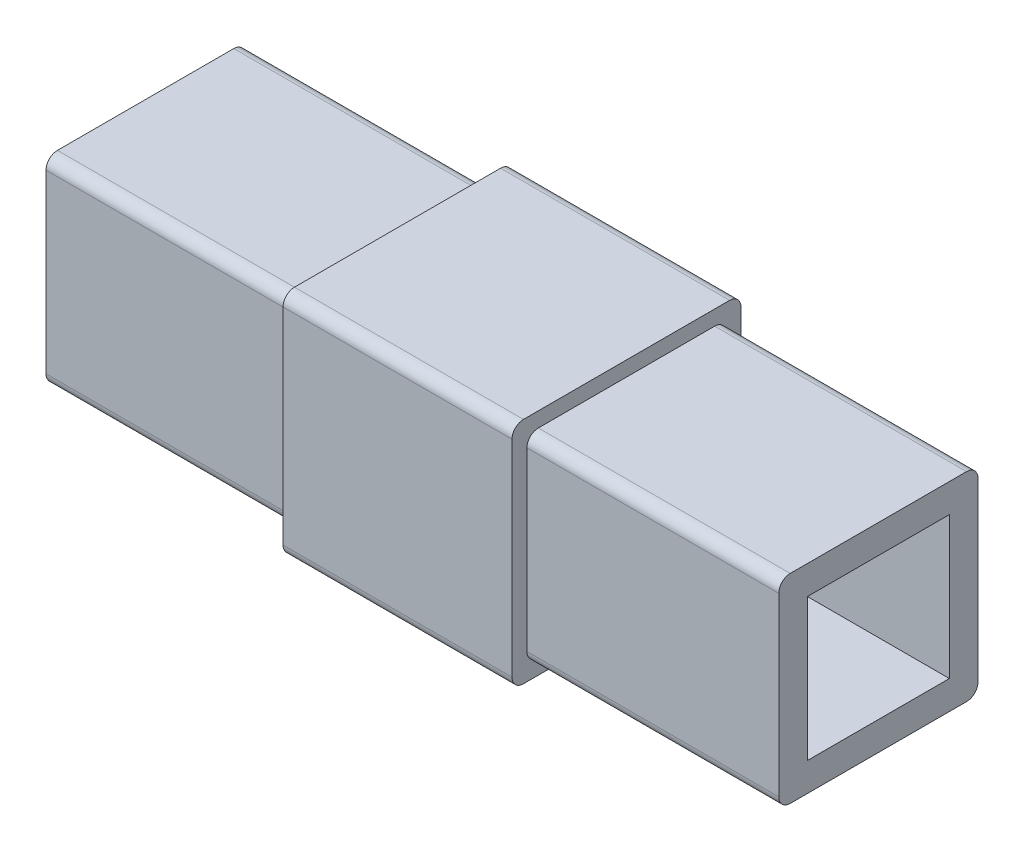
ISO-10303-21;
HEADER;
FILE_DESCRIPTION(('STEP AP214'),'2;1');
FILE_NAME('part.step','',(''),(''),'','','');
FILE_SCHEMA(('AUTOMOTIVE_DESIGN { 1 0 10303 214 1 1 1 1 }'));
ENDSEC;
DATA;
#1=APPLICATION_CONTEXT('core data for automotive mechanical design processes');
#2=APPLICATION_PROTOCOL_DEFINITION('international standard','automotive_design',2000,#1);
#3=PRODUCT_CONTEXT('',#1,'mechanical');
#4=PRODUCT('Part','Part','',(#3));
#5=PRODUCT_RELATED_PRODUCT_CATEGORY('part','',(#4));
#6=PRODUCT_DEFINITION_FORMATION('','',#4);
#7=PRODUCT_DEFINITION_CONTEXT('part definition',#1,'design');
#8=PRODUCT_DEFINITION('design','',#6,#7);
#9=PRODUCT_DEFINITION_SHAPE('','',#8);
#10=(LENGTH_UNIT() NAMED_UNIT(*) SI_UNIT(.MILLI.,.METRE.));
#11=(NAMED_UNIT(*) PLANE_ANGLE_UNIT() SI_UNIT($,.RADIAN.));
#12=(NAMED_UNIT(*) SI_UNIT($,.STERADIAN.) SOLID_ANGLE_UNIT());
#13=UNCERTAINTY_MEASURE_WITH_UNIT(LENGTH_MEASURE(1.E-05),#10,'distance_accuracy_value','');
#14=(GEOMETRIC_REPRESENTATION_CONTEXT(3) GLOBAL_UNCERTAINTY_ASSIGNED_CONTEXT((#13)) GLOBAL_UNIT_ASSIGNED_CONTEXT((#10,
#11,#12)) REPRESENTATION_CONTEXT('',''));
#15=CARTESIAN_POINT('',(0.,0.,0.));
#16=DIRECTION('',(0.,0.,1.));
#17=DIRECTION('',(1.,0.,0.));
#18=AXIS2_PLACEMENT_3D('',#15,#16,#17);
#19=CARTESIAN_POINT('',(12.7,11.43,12.7));
#20=DIRECTION('',(0.,0.,-1.));
#21=DIRECTION('',(-1.,0.,0.));
#22=AXIS2_PLACEMENT_3D('',#19,#20,#21);
#23=PLANE('',#22);
#24=DIRECTION('',(0.,-1.,0.));
#25=VECTOR('',#24,1.);
#26=CARTESIAN_POINT('',(-12.7,11.43,12.7));
#27=LINE('',#26,#25);
#28=CARTESIAN_POINT('',(-12.7,11.43,12.7));
#29=VERTEX_POINT('',#28);
#30=CARTESIAN_POINT('',(-12.7,-11.43,12.7));
#31=VERTEX_POINT('',#30);
#32=EDGE_CURVE('E10',#29,#31,#27,.T.);
#33=ORIENTED_EDGE('',*,*,#32,.T.);
#34=DIRECTION('',(-1.,0.,0.));
#35=VECTOR('',#34,1.);
#36=CARTESIAN_POINT('',(12.7,-11.43,12.7));
#37=LINE('',#36,#35);
#38=CARTESIAN_POINT('',(12.7,-11.43,12.7));
#39=VERTEX_POINT('',#38);
#40=EDGE_CURVE('E24',#39,#31,#37,.T.);
#41=ORIENTED_EDGE('',*,*,#40,.F.);
#42=DIRECTION('',(0.,-1.,0.));
#43=VECTOR('',#42,1.);
#44=CARTESIAN_POINT('',(12.7,11.43,12.7));
#45=LINE('',#44,#43);
#46=CARTESIAN_POINT('',(12.7,11.43,12.7));
#47=VERTEX_POINT('',#46);
#48=EDGE_CURVE('E667',#47,#39,#45,.T.);
#49=ORIENTED_EDGE('',*,*,#48,.F.);
#50=DIRECTION('',(-1.,0.,0.));
#51=VECTOR('',#50,1.);
#52=CARTESIAN_POINT('',(12.7,11.43,12.7));
#53=LINE('',#52,#51);
#54=EDGE_CURVE('E663',#47,#29,#53,.T.);
#55=ORIENTED_EDGE('',*,*,#54,.T.);
#56=EDGE_LOOP('',(#33,#41,#49,#55));
#57=FACE_BOUND('',#56,.T.);
#58=ADVANCED_FACE('F16',(#57),#23,.F.);
#59=CARTESIAN_POINT('',(12.7,11.4300000000002,11.4300000000002));
#60=DIRECTION('',(-1.,0.,0.));
#61=DIRECTION('',(0.,-0.707106781186548,-0.707106781186547));
#62=AXIS2_PLACEMENT_3D('',#59,#60,#61);
#63=CYLINDRICAL_SURFACE('',#62,1.26999999999977);
#64=CARTESIAN_POINT('',(-12.7,11.4300000000002,11.4300000000002));
#65=DIRECTION('',(1.,0.,0.));
#66=DIRECTION('',(0.,0.,-1.));
#67=AXIS2_PLACEMENT_3D('',#64,#65,#66);
#68=CIRCLE('',#67,1.26999999999977);
#69=CARTESIAN_POINT('',(-12.7,12.7,11.43));
#70=VERTEX_POINT('',#69);
#71=EDGE_CURVE('E658',#70,#29,#68,.T.);
#72=ORIENTED_EDGE('',*,*,#71,.T.);
#73=ORIENTED_EDGE('',*,*,#54,.F.);
#74=CARTESIAN_POINT('',(12.7,11.4300000000002,11.4300000000002));
#75=DIRECTION('',(1.,0.,0.));
#76=DIRECTION('',(0.,0.,-1.));
#77=AXIS2_PLACEMENT_3D('',#74,#75,#76);
#78=CIRCLE('',#77,1.26999999999977);
#79=CARTESIAN_POINT('',(12.7,12.7,11.43));
#80=VERTEX_POINT('',#79);
#81=EDGE_CURVE('E653',#80,#47,#78,.T.);
#82=ORIENTED_EDGE('',*,*,#81,.F.);
#83=DIRECTION('',(-1.,0.,0.));
#84=VECTOR('',#83,1.);
#85=CARTESIAN_POINT('',(12.7,12.7,11.43));
#86=LINE('',#85,#84);
#87=EDGE_CURVE('E649',#80,#70,#86,.T.);
#88=ORIENTED_EDGE('',*,*,#87,.T.);
#89=EDGE_LOOP('',(#72,#73,#82,#88));
#90=FACE_BOUND('',#89,.T.);
#91=ADVANCED_FACE('F685',(#90),#63,.T.);
#92=CARTESIAN_POINT('',(12.7,12.7,-11.43));
#93=DIRECTION('',(0.,-1.,0.));
#94=DIRECTION('',(0.,0.,-1.));
#95=AXIS2_PLACEMENT_3D('',#92,#93,#94);
#96=PLANE('',#95);
#97=DIRECTION('',(0.,0.,1.));
#98=VECTOR('',#97,1.);
#99=CARTESIAN_POINT('',(-12.7,12.7,-11.43));
#100=LINE('',#99,#98);
#101=CARTESIAN_POINT('',(-12.7,12.7,-11.43));
#102=VERTEX_POINT('',#101);
#103=EDGE_CURVE('E644',#102,#70,#100,.T.);
#104=ORIENTED_EDGE('',*,*,#103,.T.);
#105=ORIENTED_EDGE('',*,*,#87,.F.);
#106=DIRECTION('',(0.,0.,1.));
#107=VECTOR('',#106,1.);
#108=CARTESIAN_POINT('',(12.7,12.7,-11.43));
#109=LINE('',#108,#107);
#110=CARTESIAN_POINT('',(12.7,12.7,-11.43));
#111=VERTEX_POINT('',#110);
#112=EDGE_CURVE('E639',#111,#80,#109,.T.);
#113=ORIENTED_EDGE('',*,*,#112,.F.);
#114=DIRECTION('',(-1.,0.,0.));
#115=VECTOR('',#114,1.);
#116=CARTESIAN_POINT('',(12.7,12.7,-11.43));
#117=LINE('',#116,#115);
#118=EDGE_CURVE('E635',#111,#102,#117,.T.);
#119=ORIENTED_EDGE('',*,*,#118,.T.);
#120=EDGE_LOOP('',(#104,#105,#113,#119));
#121=FACE_BOUND('',#120,.T.);
#122=ADVANCED_FACE('F706',(#121),#96,.F.);
#123=CARTESIAN_POINT('',(12.7,11.4300000000002,-11.4300000000002));
#124=DIRECTION('',(-1.,0.,0.));
#125=DIRECTION('',(0.,-0.707106781186548,0.707106781186547));
#126=AXIS2_PLACEMENT_3D('',#123,#124,#125);
#127=CYLINDRICAL_SURFACE('',#126,1.26999999999977);
#128=CARTESIAN_POINT('',(-12.7,11.4300000000002,-11.4300000000002));
#129=DIRECTION('',(1.,0.,0.));
#130=DIRECTION('',(0.,0.,-1.));
#131=AXIS2_PLACEMENT_3D('',#128,#129,#130);
#132=CIRCLE('',#131,1.26999999999977);
#133=CARTESIAN_POINT('',(-12.7,11.43,-12.7));
#134=VERTEX_POINT('',#133);
#135=EDGE_CURVE('E630',#134,#102,#132,.T.);
#136=ORIENTED_EDGE('',*,*,#135,.T.);
#137=ORIENTED_EDGE('',*,*,#118,.F.);
#138=CARTESIAN_POINT('',(12.7,11.4300000000002,-11.4300000000002));
#139=DIRECTION('',(1.,0.,0.));
#140=DIRECTION('',(0.,0.,-1.));
#141=AXIS2_PLACEMENT_3D('',#138,#139,#140);
#142=CIRCLE('',#141,1.26999999999977);
#143=CARTESIAN_POINT('',(12.7,11.43,-12.7));
#144=VERTEX_POINT('',#143);
#145=EDGE_CURVE('E625',#144,#111,#142,.T.);
#146=ORIENTED_EDGE('',*,*,#145,.F.);
#147=DIRECTION('',(-1.,0.,0.));
#148=VECTOR('',#147,1.);
#149=CARTESIAN_POINT('',(12.7,11.43,-12.7));
#150=LINE('',#149,#148);
#151=EDGE_CURVE('E621',#144,#134,#150,.T.);
#152=ORIENTED_EDGE('',*,*,#151,.T.);
#153=EDGE_LOOP('',(#136,#137,#146,#152));
#154=FACE_BOUND('',#153,.T.);
#155=ADVANCED_FACE('F703',(#154),#127,.T.);
#156=CARTESIAN_POINT('',(12.7,-11.43,-12.7));
#157=DIRECTION('',(0.,0.,1.));
#158=DIRECTION('',(1.,0.,0.));
#159=AXIS2_PLACEMENT_3D('',#156,#157,#158);
#160=PLANE('',#159);
#161=DIRECTION('',(0.,1.,0.));
#162=VECTOR('',#161,1.);
#163=CARTESIAN_POINT('',(-12.7,-11.43,-12.7));
#164=LINE('',#163,#162);
#165=CARTESIAN_POINT('',(-12.7,-11.43,-12.7));
#166=VERTEX_POINT('',#165);
#167=EDGE_CURVE('E616',#166,#134,#164,.T.);
#168=ORIENTED_EDGE('',*,*,#167,.T.);
#169=ORIENTED_EDGE('',*,*,#151,.F.);
#170=DIRECTION('',(0.,1.,0.));
#171=VECTOR('',#170,1.);
#172=CARTESIAN_POINT('',(12.7,-11.43,-12.7));
#173=LINE('',#172,#171);
#174=CARTESIAN_POINT('',(12.7,-11.43,-12.7));
#175=VERTEX_POINT('',#174);
#176=EDGE_CURVE('E611',#175,#144,#173,.T.);
#177=ORIENTED_EDGE('',*,*,#176,.F.);
#178=DIRECTION('',(-1.,0.,0.));
#179=VECTOR('',#178,1.);
#180=CARTESIAN_POINT('',(12.7,-11.43,-12.7));
#181=LINE('',#180,#179);
#182=EDGE_CURVE('E607',#175,#166,#181,.T.);
#183=ORIENTED_EDGE('',*,*,#182,.T.);
#184=EDGE_LOOP('',(#168,#169,#177,#183));
#185=FACE_BOUND('',#184,.T.);
#186=ADVANCED_FACE('F699',(#185),#160,.F.);
#187=CARTESIAN_POINT('',(12.7,-11.4300000000002,-11.4300000000002));
#188=DIRECTION('',(-1.,0.,0.));
#189=DIRECTION('',(0.,0.707106781186548,0.707106781186547));
#190=AXIS2_PLACEMENT_3D('',#187,#188,#189);
#191=CYLINDRICAL_SURFACE('',#190,1.26999999999977);
#192=CARTESIAN_POINT('',(-12.7,-11.4300000000002,-11.4300000000002));
#193=DIRECTION('',(1.,0.,0.));
#194=DIRECTION('',(0.,0.,-1.));
#195=AXIS2_PLACEMENT_3D('',#192,#193,#194);
#196=CIRCLE('',#195,1.26999999999977);
#197=CARTESIAN_POINT('',(-12.7,-12.7,-11.43));
#198=VERTEX_POINT('',#197);
#199=EDGE_CURVE('E602',#198,#166,#196,.T.);
#200=ORIENTED_EDGE('',*,*,#199,.T.);
#201=ORIENTED_EDGE('',*,*,#182,.F.);
#202=CARTESIAN_POINT('',(12.7,-11.4300000000002,-11.4300000000002));
#203=DIRECTION('',(1.,0.,0.));
#204=DIRECTION('',(0.,0.,-1.));
#205=AXIS2_PLACEMENT_3D('',#202,#203,#204);
#206=CIRCLE('',#205,1.26999999999977);
#207=CARTESIAN_POINT('',(12.7,-12.7,-11.43));
#208=VERTEX_POINT('',#207);
#209=EDGE_CURVE('E597',#208,#175,#206,.T.);
#210=ORIENTED_EDGE('',*,*,#209,.F.);
#211=DIRECTION('',(-1.,0.,0.));
#212=VECTOR('',#211,1.);
#213=CARTESIAN_POINT('',(12.7,-12.7,-11.43));
#214=LINE('',#213,#212);
#215=EDGE_CURVE('E593',#208,#198,#214,.T.);
#216=ORIENTED_EDGE('',*,*,#215,.T.);
#217=EDGE_LOOP('',(#200,#201,#210,#216));
#218=FACE_BOUND('',#217,.T.);
#219=ADVANCED_FACE('F697',(#218),#191,.T.);
#220=CARTESIAN_POINT('',(12.7,-12.7,11.43));
#221=DIRECTION('',(0.,1.,0.));
#222=DIRECTION('',(0.,0.,1.));
#223=AXIS2_PLACEMENT_3D('',#220,#221,#222);
#224=PLANE('',#223);
#225=DIRECTION('',(0.,0.,-1.));
#226=VECTOR('',#225,1.);
#227=CARTESIAN_POINT('',(-12.7,-12.7,11.43));
#228=LINE('',#227,#226);
#229=CARTESIAN_POINT('',(-12.7,-12.7,11.43));
#230=VERTEX_POINT('',#229);
#231=EDGE_CURVE('E588',#230,#198,#228,.T.);
#232=ORIENTED_EDGE('',*,*,#231,.T.);
#233=ORIENTED_EDGE('',*,*,#215,.F.);
#234=DIRECTION('',(0.,0.,-1.));
#235=VECTOR('',#234,1.);
#236=CARTESIAN_POINT('',(12.7,-12.7,11.43));
#237=LINE('',#236,#235);
#238=CARTESIAN_POINT('',(12.7,-12.7,11.43));
#239=VERTEX_POINT('',#238);
#240=EDGE_CURVE('E583',#239,#208,#237,.T.);
#241=ORIENTED_EDGE('',*,*,#240,.F.);
#242=DIRECTION('',(-1.,0.,0.));
#243=VECTOR('',#242,1.);
#244=CARTESIAN_POINT('',(12.7,-12.7,11.43));
#245=LINE('',#244,#243);
#246=EDGE_CURVE('E579',#239,#230,#245,.T.);
#247=ORIENTED_EDGE('',*,*,#246,.T.);
#248=EDGE_LOOP('',(#232,#233,#241,#247));
#249=FACE_BOUND('',#248,.T.);
#250=ADVANCED_FACE('F694',(#249),#224,.F.);
#251=CARTESIAN_POINT('',(12.7,-11.4300000000002,11.4300000000002));
#252=DIRECTION('',(-1.,0.,0.));
#253=DIRECTION('',(0.,0.707106781186547,-0.707106781186548));
#254=AXIS2_PLACEMENT_3D('',#251,#252,#253);
#255=CYLINDRICAL_SURFACE('',#254,1.26999999999977);
#256=CARTESIAN_POINT('',(-12.7,-11.4300000000002,11.4300000000002));
#257=DIRECTION('',(1.,0.,0.));
#258=DIRECTION('',(0.,0.,-1.));
#259=AXIS2_PLACEMENT_3D('',#256,#257,#258);
#260=CIRCLE('',#259,1.26999999999977);
#261=EDGE_CURVE('E574',#31,#230,#260,.T.);
#262=ORIENTED_EDGE('',*,*,#261,.T.);
#263=ORIENTED_EDGE('',*,*,#246,.F.);
#264=CARTESIAN_POINT('',(12.7,-11.4300000000002,11.4300000000002));
#265=DIRECTION('',(1.,0.,0.));
#266=DIRECTION('',(0.,0.,-1.));
#267=AXIS2_PLACEMENT_3D('',#264,#265,#266);
#268=CIRCLE('',#267,1.26999999999977);
#269=EDGE_CURVE('E569',#39,#239,#268,.T.);
#270=ORIENTED_EDGE('',*,*,#269,.F.);
#271=ORIENTED_EDGE('',*,*,#40,.T.);
#272=EDGE_LOOP('',(#262,#263,#270,#271));
#273=FACE_BOUND('',#272,.T.);
#274=ADVANCED_FACE('F677',(#273),#255,.T.);
#275=CARTESIAN_POINT('',(12.7,-11.4300000000002,11.4300000000002));
#276=DIRECTION('',(1.,0.,0.));
#277=DIRECTION('',(0.,0.,-1.));
#278=AXIS2_PLACEMENT_3D('',#275,#276,#277);
#279=PLANE('',#278);
#280=CARTESIAN_POINT('',(12.7,-9.77900000000023,9.77900000000023));
#281=DIRECTION('',(-1.,0.,0.));
#282=DIRECTION('',(0.,0.,-1.));
#283=AXIS2_PLACEMENT_3D('',#280,#281,#282);
#284=CIRCLE('',#283,1.26999999999977);
#285=CARTESIAN_POINT('',(12.7,-11.049,9.779));
#286=VERTEX_POINT('',#285);
#287=CARTESIAN_POINT('',(12.7,-9.779,11.049));
#288=VERTEX_POINT('',#287);
#289=EDGE_CURVE('E565',#286,#288,#284,.T.);
#290=ORIENTED_EDGE('',*,*,#289,.T.);
#291=DIRECTION('',(0.,1.,0.));
#292=VECTOR('',#291,1.);
#293=CARTESIAN_POINT('',(12.7,-11.4300000000002,11.049));
#294=LINE('',#293,#292);
#295=CARTESIAN_POINT('',(12.7,9.779,11.049));
#296=VERTEX_POINT('',#295);
#297=EDGE_CURVE('E561',#288,#296,#294,.T.);
#298=ORIENTED_EDGE('',*,*,#297,.T.);
#299=CARTESIAN_POINT('',(12.7,9.77900000000023,9.77900000000023));
#300=DIRECTION('',(-1.,0.,0.));
#301=DIRECTION('',(0.,0.,-1.));
#302=AXIS2_PLACEMENT_3D('',#299,#300,#301);
#303=CIRCLE('',#302,1.26999999999977);
#304=CARTESIAN_POINT('',(12.7,11.049,9.779));
#305=VERTEX_POINT('',#304);
#306=EDGE_CURVE('E557',#296,#305,#303,.T.);
#307=ORIENTED_EDGE('',*,*,#306,.T.);
#308=DIRECTION('',(0.,0.,-1.));
#309=VECTOR('',#308,1.);
#310=CARTESIAN_POINT('',(12.7,11.049,11.4300000000002));
#311=LINE('',#310,#309);
#312=CARTESIAN_POINT('',(12.7,11.049,-9.779));
#313=VERTEX_POINT('',#312);
#314=EDGE_CURVE('E553',#305,#313,#311,.T.);
#315=ORIENTED_EDGE('',*,*,#314,.T.);
#316=CARTESIAN_POINT('',(12.7,9.77900000000023,-9.77900000000023));
#317=DIRECTION('',(-1.,0.,0.));
#318=DIRECTION('',(0.,0.,-1.));
#319=AXIS2_PLACEMENT_3D('',#316,#317,#318);
#320=CIRCLE('',#319,1.26999999999977);
#321=CARTESIAN_POINT('',(12.7,9.779,-11.049));
#322=VERTEX_POINT('',#321);
#323=EDGE_CURVE('E549',#313,#322,#320,.T.);
#324=ORIENTED_EDGE('',*,*,#323,.T.);
#325=DIRECTION('',(0.,-1.,0.));
#326=VECTOR('',#325,1.);
#327=CARTESIAN_POINT('',(12.7,-11.4300000000002,-11.049));
#328=LINE('',#327,#326);
#329=CARTESIAN_POINT('',(12.7,-9.779,-11.049));
#330=VERTEX_POINT('',#329);
#331=EDGE_CURVE('E545',#322,#330,#328,.T.);
#332=ORIENTED_EDGE('',*,*,#331,.T.);
#333=CARTESIAN_POINT('',(12.7,-9.77900000000023,-9.77900000000023));
#334=DIRECTION('',(-1.,0.,0.));
#335=DIRECTION('',(0.,0.,-1.));
#336=AXIS2_PLACEMENT_3D('',#333,#334,#335);
#337=CIRCLE('',#336,1.26999999999977);
#338=CARTESIAN_POINT('',(12.7,-11.049,-9.779));
#339=VERTEX_POINT('',#338);
#340=EDGE_CURVE('E541',#330,#339,#337,.T.);
#341=ORIENTED_EDGE('',*,*,#340,.T.);
#342=DIRECTION('',(0.,0.,1.));
#343=VECTOR('',#342,1.);
#344=CARTESIAN_POINT('',(12.7,-11.049,11.4300000000002));
#345=LINE('',#344,#343);
#346=EDGE_CURVE('E537',#339,#286,#345,.T.);
#347=ORIENTED_EDGE('',*,*,#346,.T.);
#348=EDGE_LOOP('',(#290,#298,#307,#315,#324,#332,#341,#347));
#349=FACE_BOUND('',#348,.T.);
#350=ORIENTED_EDGE('',*,*,#48,.T.);
#351=ORIENTED_EDGE('',*,*,#269,.T.);
#352=ORIENTED_EDGE('',*,*,#240,.T.);
#353=ORIENTED_EDGE('',*,*,#209,.T.);
#354=ORIENTED_EDGE('',*,*,#176,.T.);
#355=ORIENTED_EDGE('',*,*,#145,.T.);
#356=ORIENTED_EDGE('',*,*,#112,.T.);
#357=ORIENTED_EDGE('',*,*,#81,.T.);
#358=EDGE_LOOP('',(#350,#351,#352,#353,#354,#355,#356,#357));
#359=FACE_BOUND('',#358,.T.);
#360=ADVANCED_FACE('F681',(#349,#359),#279,.T.);
#361=CARTESIAN_POINT('',(40.64,-11.049,9.779));
#362=DIRECTION('',(0.,1.,0.));
#363=DIRECTION('',(0.,0.,1.));
#364=AXIS2_PLACEMENT_3D('',#361,#362,#363);
#365=PLANE('',#364);
#366=ORIENTED_EDGE('',*,*,#346,.F.);
#367=DIRECTION('',(-1.,0.,0.));
#368=VECTOR('',#367,1.);
#369=CARTESIAN_POINT('',(40.64,-11.049,-9.779));
#370=LINE('',#369,#368);
#371=CARTESIAN_POINT('',(40.64,-11.049,-9.779));
#372=VERTEX_POINT('',#371);
#373=EDGE_CURVE('E532',#372,#339,#370,.T.);
#374=ORIENTED_EDGE('',*,*,#373,.F.);
#375=DIRECTION('',(0.,0.,-1.));
#376=VECTOR('',#375,1.);
#377=CARTESIAN_POINT('',(40.64,-11.049,9.779));
#378=LINE('',#377,#376);
#379=CARTESIAN_POINT('',(40.64,-11.049,9.779));
#380=VERTEX_POINT('',#379);
#381=EDGE_CURVE('E527',#380,#372,#378,.T.);
#382=ORIENTED_EDGE('',*,*,#381,.F.);
#383=DIRECTION('',(-1.,0.,0.));
#384=VECTOR('',#383,1.);
#385=CARTESIAN_POINT('',(40.64,-11.049,9.779));
#386=LINE('',#385,#384);
#387=EDGE_CURVE('E522',#380,#286,#386,.T.);
#388=ORIENTED_EDGE('',*,*,#387,.T.);
#389=EDGE_LOOP('',(#366,#374,#382,#388));
#390=FACE_BOUND('',#389,.T.);
#391=ADVANCED_FACE('F785',(#390),#365,.F.);
#392=CARTESIAN_POINT('',(40.64,-9.77900000000023,9.77900000000023));
#393=DIRECTION('',(-1.,0.,0.));
#394=DIRECTION('',(0.,0.707106781186547,-0.707106781186548));
#395=AXIS2_PLACEMENT_3D('',#392,#393,#394);
#396=CYLINDRICAL_SURFACE('',#395,1.26999999999977);
#397=ORIENTED_EDGE('',*,*,#289,.F.);
#398=ORIENTED_EDGE('',*,*,#387,.F.);
#399=CARTESIAN_POINT('',(40.64,-9.77900000000023,9.77900000000023));
#400=DIRECTION('',(1.,0.,0.));
#401=DIRECTION('',(0.,0.,-1.));
#402=AXIS2_PLACEMENT_3D('',#399,#400,#401);
#403=CIRCLE('',#402,1.26999999999977);
#404=CARTESIAN_POINT('',(40.64,-9.779,11.049));
#405=VERTEX_POINT('',#404);
#406=EDGE_CURVE('E517',#405,#380,#403,.T.);
#407=ORIENTED_EDGE('',*,*,#406,.F.);
#408=DIRECTION('',(-1.,0.,0.));
#409=VECTOR('',#408,1.);
#410=CARTESIAN_POINT('',(40.64,-9.779,11.049));
#411=LINE('',#410,#409);
#412=EDGE_CURVE('E512',#405,#288,#411,.T.);
#413=ORIENTED_EDGE('',*,*,#412,.T.);
#414=EDGE_LOOP('',(#397,#398,#407,#413));
#415=FACE_BOUND('',#414,.T.);
#416=ADVANCED_FACE('F796',(#415),#396,.T.);
#417=CARTESIAN_POINT('',(40.64,9.779,11.049));
#418=DIRECTION('',(0.,0.,-1.));
#419=DIRECTION('',(-1.,0.,0.));
#420=AXIS2_PLACEMENT_3D('',#417,#418,#419);
#421=PLANE('',#420);
#422=ORIENTED_EDGE('',*,*,#297,.F.);
#423=ORIENTED_EDGE('',*,*,#412,.F.);
#424=DIRECTION('',(0.,-1.,0.));
#425=VECTOR('',#424,1.);
#426=CARTESIAN_POINT('',(40.64,9.779,11.049));
#427=LINE('',#426,#425);
#428=CARTESIAN_POINT('',(40.64,9.779,11.049));
#429=VERTEX_POINT('',#428);
#430=EDGE_CURVE('E507',#429,#405,#427,.T.);
#431=ORIENTED_EDGE('',*,*,#430,.F.);
#432=DIRECTION('',(-1.,0.,0.));
#433=VECTOR('',#432,1.);
#434=CARTESIAN_POINT('',(40.64,9.779,11.049));
#435=LINE('',#434,#433);
#436=EDGE_CURVE('E502',#429,#296,#435,.T.);
#437=ORIENTED_EDGE('',*,*,#436,.T.);
#438=EDGE_LOOP('',(#422,#423,#431,#437));
#439=FACE_BOUND('',#438,.T.);
#440=ADVANCED_FACE('F807',(#439),#421,.F.);
#441=CARTESIAN_POINT('',(40.64,9.77900000000023,9.77900000000023));
#442=DIRECTION('',(-1.,0.,0.));
#443=DIRECTION('',(0.,-0.707106781186548,-0.707106781186547));
#444=AXIS2_PLACEMENT_3D('',#441,#442,#443);
#445=CYLINDRICAL_SURFACE('',#444,1.26999999999977);
#446=ORIENTED_EDGE('',*,*,#306,.F.);
#447=ORIENTED_EDGE('',*,*,#436,.F.);
#448=CARTESIAN_POINT('',(40.64,9.77900000000023,9.77900000000023));
#449=DIRECTION('',(1.,0.,0.));
#450=DIRECTION('',(0.,0.,-1.));
#451=AXIS2_PLACEMENT_3D('',#448,#449,#450);
#452=CIRCLE('',#451,1.26999999999977);
#453=CARTESIAN_POINT('',(40.64,11.049,9.779));
#454=VERTEX_POINT('',#453);
#455=EDGE_CURVE('E497',#454,#429,#452,.T.);
#456=ORIENTED_EDGE('',*,*,#455,.F.);
#457=DIRECTION('',(-1.,0.,0.));
#458=VECTOR('',#457,1.);
#459=CARTESIAN_POINT('',(40.64,11.049,9.779));
#460=LINE('',#459,#458);
#461=EDGE_CURVE('E492',#454,#305,#460,.T.);
#462=ORIENTED_EDGE('',*,*,#461,.T.);
#463=EDGE_LOOP('',(#446,#447,#456,#462));
#464=FACE_BOUND('',#463,.T.);
#465=ADVANCED_FACE('F818',(#464),#445,.T.);
#466=CARTESIAN_POINT('',(40.64,11.049,-9.779));
#467=DIRECTION('',(0.,-1.,0.));
#468=DIRECTION('',(0.,0.,-1.));
#469=AXIS2_PLACEMENT_3D('',#466,#467,#468);
#470=PLANE('',#469);
#471=ORIENTED_EDGE('',*,*,#314,.F.);
#472=ORIENTED_EDGE('',*,*,#461,.F.);
#473=DIRECTION('',(0.,0.,1.));
#474=VECTOR('',#473,1.);
#475=CARTESIAN_POINT('',(40.64,11.049,-9.779));
#476=LINE('',#475,#474);
#477=CARTESIAN_POINT('',(40.64,11.049,-9.779));
#478=VERTEX_POINT('',#477);
#479=EDGE_CURVE('E487',#478,#454,#476,.T.);
#480=ORIENTED_EDGE('',*,*,#479,.F.);
#481=DIRECTION('',(-1.,0.,0.));
#482=VECTOR('',#481,1.);
#483=CARTESIAN_POINT('',(40.64,11.049,-9.779));
#484=LINE('',#483,#482);
#485=EDGE_CURVE('E482',#478,#313,#484,.T.);
#486=ORIENTED_EDGE('',*,*,#485,.T.);
#487=EDGE_LOOP('',(#471,#472,#480,#486));
#488=FACE_BOUND('',#487,.T.);
#489=ADVANCED_FACE('F829',(#488),#470,.F.);
#490=CARTESIAN_POINT('',(40.64,9.77900000000023,-9.77900000000023));
#491=DIRECTION('',(-1.,0.,0.));
#492=DIRECTION('',(0.,-0.707106781186548,0.707106781186547));
#493=AXIS2_PLACEMENT_3D('',#490,#491,#492);
#494=CYLINDRICAL_SURFACE('',#493,1.26999999999977);
#495=ORIENTED_EDGE('',*,*,#323,.F.);
#496=ORIENTED_EDGE('',*,*,#485,.F.);
#497=CARTESIAN_POINT('',(40.64,9.77900000000023,-9.77900000000023));
#498=DIRECTION('',(1.,0.,0.));
#499=DIRECTION('',(0.,0.,-1.));
#500=AXIS2_PLACEMENT_3D('',#497,#498,#499);
#501=CIRCLE('',#500,1.26999999999977);
#502=CARTESIAN_POINT('',(40.64,9.779,-11.049));
#503=VERTEX_POINT('',#502);
#504=EDGE_CURVE('E477',#503,#478,#501,.T.);
#505=ORIENTED_EDGE('',*,*,#504,.F.);
#506=DIRECTION('',(-1.,0.,0.));
#507=VECTOR('',#506,1.);
#508=CARTESIAN_POINT('',(40.64,9.779,-11.049));
#509=LINE('',#508,#507);
#510=EDGE_CURVE('E472',#503,#322,#509,.T.);
#511=ORIENTED_EDGE('',*,*,#510,.T.);
#512=EDGE_LOOP('',(#495,#496,#505,#511));
#513=FACE_BOUND('',#512,.T.);
#514=ADVANCED_FACE('F840',(#513),#494,.T.);
#515=CARTESIAN_POINT('',(40.64,-9.779,-11.049));
#516=DIRECTION('',(0.,0.,1.));
#517=DIRECTION('',(1.,0.,0.));
#518=AXIS2_PLACEMENT_3D('',#515,#516,#517);
#519=PLANE('',#518);
#520=ORIENTED_EDGE('',*,*,#331,.F.);
#521=ORIENTED_EDGE('',*,*,#510,.F.);
#522=DIRECTION('',(0.,1.,0.));
#523=VECTOR('',#522,1.);
#524=CARTESIAN_POINT('',(40.64,-9.779,-11.049));
#525=LINE('',#524,#523);
#526=CARTESIAN_POINT('',(40.64,-9.779,-11.049));
#527=VERTEX_POINT('',#526);
#528=EDGE_CURVE('E467',#527,#503,#525,.T.);
#529=ORIENTED_EDGE('',*,*,#528,.F.);
#530=DIRECTION('',(-1.,0.,0.));
#531=VECTOR('',#530,1.);
#532=CARTESIAN_POINT('',(40.64,-9.779,-11.049));
#533=LINE('',#532,#531);
#534=EDGE_CURVE('E462',#527,#330,#533,.T.);
#535=ORIENTED_EDGE('',*,*,#534,.T.);
#536=EDGE_LOOP('',(#520,#521,#529,#535));
#537=FACE_BOUND('',#536,.T.);
#538=ADVANCED_FACE('F851',(#537),#519,.F.);
#539=CARTESIAN_POINT('',(40.64,-9.77900000000023,-9.77900000000023));
#540=DIRECTION('',(-1.,0.,0.));
#541=DIRECTION('',(0.,0.707106781186548,0.707106781186548));
#542=AXIS2_PLACEMENT_3D('',#539,#540,#541);
#543=CYLINDRICAL_SURFACE('',#542,1.26999999999977);
#544=ORIENTED_EDGE('',*,*,#340,.F.);
#545=ORIENTED_EDGE('',*,*,#534,.F.);
#546=CARTESIAN_POINT('',(40.64,-9.77900000000023,-9.77900000000023));
#547=DIRECTION('',(1.,0.,0.));
#548=DIRECTION('',(0.,0.,-1.));
#549=AXIS2_PLACEMENT_3D('',#546,#547,#548);
#550=CIRCLE('',#549,1.26999999999977);
#551=EDGE_CURVE('E457',#372,#527,#550,.T.);
#552=ORIENTED_EDGE('',*,*,#551,.F.);
#553=ORIENTED_EDGE('',*,*,#373,.T.);
#554=EDGE_LOOP('',(#544,#545,#552,#553));
#555=FACE_BOUND('',#554,.T.);
#556=ADVANCED_FACE('F862',(#555),#543,.T.);
#557=CARTESIAN_POINT('',(40.64,-9.77900000000023,9.77900000000023));
#558=DIRECTION('',(1.,0.,0.));
#559=DIRECTION('',(0.,0.,-1.));
#560=AXIS2_PLACEMENT_3D('',#557,#558,#559);
#561=PLANE('',#560);
#562=DIRECTION('',(0.,0.,1.));
#563=VECTOR('',#562,1.);
#564=CARTESIAN_POINT('',(40.64,7.874,-7.874));
#565=LINE('',#564,#563);
#566=CARTESIAN_POINT('',(40.64,7.874,-7.874));
#567=VERTEX_POINT('',#566);
#568=CARTESIAN_POINT('',(40.64,7.874,7.874));
#569=VERTEX_POINT('',#568);
#570=EDGE_CURVE('E452',#567,#569,#565,.T.);
#571=ORIENTED_EDGE('',*,*,#570,.F.);
#572=DIRECTION('',(0.,1.,0.));
#573=VECTOR('',#572,1.);
#574=CARTESIAN_POINT('',(40.64,-7.874,-7.874));
#575=LINE('',#574,#573);
#576=CARTESIAN_POINT('',(40.64,-7.874,-7.874));
#577=VERTEX_POINT('',#576);
#578=EDGE_CURVE('E447',#577,#567,#575,.T.);
#579=ORIENTED_EDGE('',*,*,#578,.F.);
#580=DIRECTION('',(0.,0.,-1.));
#581=VECTOR('',#580,1.);
#582=CARTESIAN_POINT('',(40.64,-7.874,7.874));
#583=LINE('',#582,#581);
#584=CARTESIAN_POINT('',(40.64,-7.874,7.874));
#585=VERTEX_POINT('',#584);
#586=EDGE_CURVE('E442',#585,#577,#583,.T.);
#587=ORIENTED_EDGE('',*,*,#586,.F.);
#588=DIRECTION('',(0.,-1.,0.));
#589=VECTOR('',#588,1.);
#590=CARTESIAN_POINT('',(40.64,7.874,7.874));
#591=LINE('',#590,#589);
#592=EDGE_CURVE('E437',#569,#585,#591,.T.);
#593=ORIENTED_EDGE('',*,*,#592,.F.);
#594=EDGE_LOOP('',(#571,#579,#587,#593));
#595=FACE_BOUND('',#594,.T.);
#596=ORIENTED_EDGE('',*,*,#430,.T.);
#597=ORIENTED_EDGE('',*,*,#406,.T.);
#598=ORIENTED_EDGE('',*,*,#381,.T.);
#599=ORIENTED_EDGE('',*,*,#551,.T.);
#600=ORIENTED_EDGE('',*,*,#528,.T.);
#601=ORIENTED_EDGE('',*,*,#504,.T.);
#602=ORIENTED_EDGE('',*,*,#479,.T.);
#603=ORIENTED_EDGE('',*,*,#455,.T.);
#604=EDGE_LOOP('',(#596,#597,#598,#599,#600,#601,#602,#603));
#605=FACE_BOUND('',#604,.T.);
#606=ADVANCED_FACE('F873',(#595,#605),#561,.T.);
#607=CARTESIAN_POINT('',(40.64,7.874,7.874));
#608=DIRECTION('',(0.,0.,-1.));
#609=DIRECTION('',(-1.,0.,0.));
#610=AXIS2_PLACEMENT_3D('',#607,#608,#609);
#611=PLANE('',#610);
#612=DIRECTION('',(-1.,0.,0.));
#613=VECTOR('',#612,1.);
#614=CARTESIAN_POINT('',(40.64,-7.874,7.874));
#615=LINE('',#614,#613);
#616=CARTESIAN_POINT('',(12.7,-7.874,7.874));
#617=VERTEX_POINT('',#616);
#618=EDGE_CURVE('E433',#585,#617,#615,.T.);
#619=ORIENTED_EDGE('',*,*,#618,.T.);
#620=DIRECTION('',(0.,1.,0.));
#621=VECTOR('',#620,1.);
#622=CARTESIAN_POINT('',(12.7,-11.4300000000002,7.874));
#623=LINE('',#622,#621);
#624=CARTESIAN_POINT('',(12.7,7.874,7.874));
#625=VERTEX_POINT('',#624);
#626=EDGE_CURVE('E429',#617,#625,#623,.T.);
#627=ORIENTED_EDGE('',*,*,#626,.T.);
#628=DIRECTION('',(-1.,0.,0.));
#629=VECTOR('',#628,1.);
#630=CARTESIAN_POINT('',(40.64,7.874,7.874));
#631=LINE('',#630,#629);
#632=EDGE_CURVE('E424',#569,#625,#631,.T.);
#633=ORIENTED_EDGE('',*,*,#632,.F.);
#634=ORIENTED_EDGE('',*,*,#592,.T.);
#635=EDGE_LOOP('',(#619,#627,#633,#634));
#636=FACE_BOUND('',#635,.T.);
#637=ADVANCED_FACE('F884',(#636),#611,.T.);
#638=CARTESIAN_POINT('',(40.64,7.874,-7.874));
#639=DIRECTION('',(0.,-1.,0.));
#640=DIRECTION('',(0.,0.,-1.));
#641=AXIS2_PLACEMENT_3D('',#638,#639,#640);
#642=PLANE('',#641);
#643=ORIENTED_EDGE('',*,*,#632,.T.);
#644=DIRECTION('',(0.,0.,-1.));
#645=VECTOR('',#644,1.);
#646=CARTESIAN_POINT('',(12.7,7.874,11.4300000000002));
#647=LINE('',#646,#645);
#648=CARTESIAN_POINT('',(12.7,7.874,-7.874));
#649=VERTEX_POINT('',#648);
#650=EDGE_CURVE('E420',#625,#649,#647,.T.);
#651=ORIENTED_EDGE('',*,*,#650,.T.);
#652=DIRECTION('',(-1.,0.,0.));
#653=VECTOR('',#652,1.);
#654=CARTESIAN_POINT('',(40.64,7.874,-7.874));
#655=LINE('',#654,#653);
#656=EDGE_CURVE('E415',#567,#649,#655,.T.);
#657=ORIENTED_EDGE('',*,*,#656,.F.);
#658=ORIENTED_EDGE('',*,*,#570,.T.);
#659=EDGE_LOOP('',(#643,#651,#657,#658));
#660=FACE_BOUND('',#659,.T.);
#661=ADVANCED_FACE('F895',(#660),#642,.T.);
#662=CARTESIAN_POINT('',(40.64,-7.874,-7.874));
#663=DIRECTION('',(0.,0.,1.));
#664=DIRECTION('',(1.,0.,0.));
#665=AXIS2_PLACEMENT_3D('',#662,#663,#664);
#666=PLANE('',#665);
#667=ORIENTED_EDGE('',*,*,#656,.T.);
#668=DIRECTION('',(0.,-1.,0.));
#669=VECTOR('',#668,1.);
#670=CARTESIAN_POINT('',(12.7,-11.4300000000002,-7.874));
#671=LINE('',#670,#669);
#672=CARTESIAN_POINT('',(12.7,-7.874,-7.874));
#673=VERTEX_POINT('',#672);
#674=EDGE_CURVE('E411',#649,#673,#671,.T.);
#675=ORIENTED_EDGE('',*,*,#674,.T.);
#676=DIRECTION('',(-1.,0.,0.));
#677=VECTOR('',#676,1.);
#678=CARTESIAN_POINT('',(40.64,-7.874,-7.874));
#679=LINE('',#678,#677);
#680=EDGE_CURVE('E406',#577,#673,#679,.T.);
#681=ORIENTED_EDGE('',*,*,#680,.F.);
#682=ORIENTED_EDGE('',*,*,#578,.T.);
#683=EDGE_LOOP('',(#667,#675,#681,#682));
#684=FACE_BOUND('',#683,.T.);
#685=ADVANCED_FACE('F906',(#684),#666,.T.);
#686=CARTESIAN_POINT('',(40.64,-7.874,7.874));
#687=DIRECTION('',(0.,1.,0.));
#688=DIRECTION('',(0.,0.,1.));
#689=AXIS2_PLACEMENT_3D('',#686,#687,#688);
#690=PLANE('',#689);
#691=ORIENTED_EDGE('',*,*,#680,.T.);
#692=DIRECTION('',(0.,0.,1.));
#693=VECTOR('',#692,1.);
#694=CARTESIAN_POINT('',(12.7,-7.874,11.4300000000002));
#695=LINE('',#694,#693);
#696=EDGE_CURVE('E401',#673,#617,#695,.T.);
#697=ORIENTED_EDGE('',*,*,#696,.T.);
#698=ORIENTED_EDGE('',*,*,#618,.F.);
#699=ORIENTED_EDGE('',*,*,#586,.T.);
#700=EDGE_LOOP('',(#691,#697,#698,#699));
#701=FACE_BOUND('',#700,.T.);
#702=ADVANCED_FACE('F917',(#701),#690,.T.);
#703=CARTESIAN_POINT('',(12.7,-11.4300000000002,11.4300000000002));
#704=DIRECTION('',(1.,0.,0.));
#705=DIRECTION('',(0.,0.,-1.));
#706=AXIS2_PLACEMENT_3D('',#703,#704,#705);
#707=PLANE('',#706);
#708=ORIENTED_EDGE('',*,*,#650,.F.);
#709=ORIENTED_EDGE('',*,*,#626,.F.);
#710=ORIENTED_EDGE('',*,*,#696,.F.);
#711=ORIENTED_EDGE('',*,*,#674,.F.);
#712=EDGE_LOOP('',(#708,#709,#710,#711));
#713=FACE_BOUND('',#712,.T.);
#714=ADVANCED_FACE('F928',(#713),#707,.T.);
#715=CARTESIAN_POINT('',(-12.7,-11.4300000000002,11.4300000000002));
#716=DIRECTION('',(1.,0.,0.));
#717=DIRECTION('',(0.,0.,-1.));
#718=AXIS2_PLACEMENT_3D('',#715,#716,#717);
#719=PLANE('',#718);
#720=DIRECTION('',(0.,1.,0.));
#721=VECTOR('',#720,1.);
#722=CARTESIAN_POINT('',(-12.7,-11.4300000000002,11.049));
#723=LINE('',#722,#721);
#724=CARTESIAN_POINT('',(-12.7,-9.779,11.049));
#725=VERTEX_POINT('',#724);
#726=CARTESIAN_POINT('',(-12.7,9.779,11.049));
#727=VERTEX_POINT('',#726);
#728=EDGE_CURVE('E396',#725,#727,#723,.T.);
#729=ORIENTED_EDGE('',*,*,#728,.F.);
#730=CARTESIAN_POINT('',(-12.7,-9.77900000000023,9.77900000000023));
#731=DIRECTION('',(-1.,0.,0.));
#732=DIRECTION('',(0.,0.,-1.));
#733=AXIS2_PLACEMENT_3D('',#730,#731,#732);
#734=CIRCLE('',#733,1.26999999999977);
#735=CARTESIAN_POINT('',(-12.7,-11.049,9.779));
#736=VERTEX_POINT('',#735);
#737=EDGE_CURVE('E391',#736,#725,#734,.T.);
#738=ORIENTED_EDGE('',*,*,#737,.F.);
#739=DIRECTION('',(0.,0.,1.));
#740=VECTOR('',#739,1.);
#741=CARTESIAN_POINT('',(-12.7,-11.049,11.4300000000002));
#742=LINE('',#741,#740);
#743=CARTESIAN_POINT('',(-12.7,-11.049,-9.779));
#744=VERTEX_POINT('',#743);
#745=EDGE_CURVE('E386',#744,#736,#742,.T.);
#746=ORIENTED_EDGE('',*,*,#745,.F.);
#747=CARTESIAN_POINT('',(-12.7,-9.77900000000023,-9.77900000000023));
#748=DIRECTION('',(-1.,0.,0.));
#749=DIRECTION('',(0.,0.,-1.));
#750=AXIS2_PLACEMENT_3D('',#747,#748,#749);
#751=CIRCLE('',#750,1.26999999999977);
#752=CARTESIAN_POINT('',(-12.7,-9.779,-11.049));
#753=VERTEX_POINT('',#752);
#754=EDGE_CURVE('E381',#753,#744,#751,.T.);
#755=ORIENTED_EDGE('',*,*,#754,.F.);
#756=DIRECTION('',(0.,-1.,0.));
#757=VECTOR('',#756,1.);
#758=CARTESIAN_POINT('',(-12.7,-11.4300000000002,-11.049));
#759=LINE('',#758,#757);
#760=CARTESIAN_POINT('',(-12.7,9.77900000000023,-11.049));
#761=VERTEX_POINT('',#760);
#762=EDGE_CURVE('E376',#761,#753,#759,.T.);
#763=ORIENTED_EDGE('',*,*,#762,.F.);
#764=CARTESIAN_POINT('',(-12.7,9.77900000000023,-9.77900000000023));
#765=DIRECTION('',(-1.,0.,0.));
#766=DIRECTION('',(0.,0.,-1.));
#767=AXIS2_PLACEMENT_3D('',#764,#765,#766);
#768=CIRCLE('',#767,1.26999999999977);
#769=CARTESIAN_POINT('',(-12.7,11.049,-9.779));
#770=VERTEX_POINT('',#769);
#771=EDGE_CURVE('E371',#770,#761,#768,.T.);
#772=ORIENTED_EDGE('',*,*,#771,.F.);
#773=DIRECTION('',(0.,0.,-1.));
#774=VECTOR('',#773,1.);
#775=CARTESIAN_POINT('',(-12.7,11.049,11.4300000000002));
#776=LINE('',#775,#774);
#777=CARTESIAN_POINT('',(-12.7,11.049,9.779));
#778=VERTEX_POINT('',#777);
#779=EDGE_CURVE('E366',#778,#770,#776,.T.);
#780=ORIENTED_EDGE('',*,*,#779,.F.);
#781=CARTESIAN_POINT('',(-12.7,9.77900000000023,9.77900000000023));
#782=DIRECTION('',(-1.,0.,0.));
#783=DIRECTION('',(0.,0.,-1.));
#784=AXIS2_PLACEMENT_3D('',#781,#782,#783);
#785=CIRCLE('',#784,1.26999999999977);
#786=EDGE_CURVE('E361',#727,#778,#785,.T.);
#787=ORIENTED_EDGE('',*,*,#786,.F.);
#788=EDGE_LOOP('',(#729,#738,#746,#755,#763,#772,#780,#787));
#789=FACE_BOUND('',#788,.T.);
#790=ORIENTED_EDGE('',*,*,#32,.F.);
#791=ORIENTED_EDGE('',*,*,#71,.F.);
#792=ORIENTED_EDGE('',*,*,#103,.F.);
#793=ORIENTED_EDGE('',*,*,#135,.F.);
#794=ORIENTED_EDGE('',*,*,#167,.F.);
#795=ORIENTED_EDGE('',*,*,#199,.F.);
#796=ORIENTED_EDGE('',*,*,#231,.F.);
#797=ORIENTED_EDGE('',*,*,#261,.F.);
#798=EDGE_LOOP('',(#790,#791,#792,#793,#794,#795,#796,#797));
#799=FACE_BOUND('',#798,.T.);
#800=ADVANCED_FACE('F689',(#789,#799),#719,.F.);
#801=CARTESIAN_POINT('',(40.64,9.77900000000023,9.77900000000023));
#802=DIRECTION('',(-1.,0.,0.));
#803=DIRECTION('',(0.,-0.707106781186548,-0.707106781186547));
#804=AXIS2_PLACEMENT_3D('',#801,#802,#803);
#805=CYLINDRICAL_SURFACE('',#804,1.26999999999977);
#806=DIRECTION('',(-1.,0.,0.));
#807=VECTOR('',#806,1.);
#808=CARTESIAN_POINT('',(40.64,9.779,11.049));
#809=LINE('',#808,#807);
#810=CARTESIAN_POINT('',(-40.64,9.779,11.049));
#811=VERTEX_POINT('',#810);
#812=EDGE_CURVE('E356',#727,#811,#809,.T.);
#813=ORIENTED_EDGE('',*,*,#812,.F.);
#814=ORIENTED_EDGE('',*,*,#786,.T.);
#815=DIRECTION('',(-1.,0.,0.));
#816=VECTOR('',#815,1.);
#817=CARTESIAN_POINT('',(40.64,11.049,9.779));
#818=LINE('',#817,#816);
#819=CARTESIAN_POINT('',(-40.64,11.049,9.779));
#820=VERTEX_POINT('',#819);
#821=EDGE_CURVE('E352',#778,#820,#818,.T.);
#822=ORIENTED_EDGE('',*,*,#821,.T.);
#823=CARTESIAN_POINT('',(-40.64,9.77900000000023,9.77900000000023));
#824=DIRECTION('',(1.,0.,0.));
#825=DIRECTION('',(0.,0.,-1.));
#826=AXIS2_PLACEMENT_3D('',#823,#824,#825);
#827=CIRCLE('',#826,1.26999999999977);
#828=EDGE_CURVE('E348',#820,#811,#827,.T.);
#829=ORIENTED_EDGE('',*,*,#828,.T.);
#830=EDGE_LOOP('',(#813,#814,#822,#829));
#831=FACE_BOUND('',#830,.T.);
#832=ADVANCED_FACE('F949',(#831),#805,.T.);
#833=CARTESIAN_POINT('',(-40.64,-9.77900000000023,9.77900000000023));
#834=DIRECTION('',(1.,0.,0.));
#835=DIRECTION('',(0.,0.,-1.));
#836=AXIS2_PLACEMENT_3D('',#833,#834,#835);
#837=PLANE('',#836);
#838=DIRECTION('',(0.,0.,1.));
#839=VECTOR('',#838,1.);
#840=CARTESIAN_POINT('',(-40.64,7.874,-7.874));
#841=LINE('',#840,#839);
#842=CARTESIAN_POINT('',(-40.64,7.874,-7.874));
#843=VERTEX_POINT('',#842);
#844=CARTESIAN_POINT('',(-40.64,7.874,7.874));
#845=VERTEX_POINT('',#844);
#846=EDGE_CURVE('E344',#843,#845,#841,.T.);
#847=ORIENTED_EDGE('',*,*,#846,.T.);
#848=DIRECTION('',(0.,-1.,0.));
#849=VECTOR('',#848,1.);
#850=CARTESIAN_POINT('',(-40.64,7.874,7.874));
#851=LINE('',#850,#849);
#852=CARTESIAN_POINT('',(-40.64,-7.874,7.874));
#853=VERTEX_POINT('',#852);
#854=EDGE_CURVE('E229',#845,#853,#851,.T.);
#855=ORIENTED_EDGE('',*,*,#854,.T.);
#856=DIRECTION('',(0.,0.,-1.));
#857=VECTOR('',#856,1.);
#858=CARTESIAN_POINT('',(-40.64,-7.874,7.874));
#859=LINE('',#858,#857);
#860=CARTESIAN_POINT('',(-40.64,-7.874,-7.874));
#861=VERTEX_POINT('',#860);
#862=EDGE_CURVE('E337',#853,#861,#859,.T.);
#863=ORIENTED_EDGE('',*,*,#862,.T.);
#864=DIRECTION('',(0.,1.,0.));
#865=VECTOR('',#864,1.);
#866=CARTESIAN_POINT('',(-40.64,-7.874,-7.874));
#867=LINE('',#866,#865);
#868=EDGE_CURVE('E333',#861,#843,#867,.T.);
#869=ORIENTED_EDGE('',*,*,#868,.T.);
#870=EDGE_LOOP('',(#847,#855,#863,#869));
#871=FACE_BOUND('',#870,.T.);
#872=DIRECTION('',(0.,-1.,0.));
#873=VECTOR('',#872,1.);
#874=CARTESIAN_POINT('',(-40.64,9.779,11.049));
#875=LINE('',#874,#873);
#876=CARTESIAN_POINT('',(-40.64,-9.779,11.049));
#877=VERTEX_POINT('',#876);
#878=EDGE_CURVE('E328',#811,#877,#875,.T.);
#879=ORIENTED_EDGE('',*,*,#878,.F.);
#880=ORIENTED_EDGE('',*,*,#828,.F.);
#881=DIRECTION('',(0.,0.,1.));
#882=VECTOR('',#881,1.);
#883=CARTESIAN_POINT('',(-40.64,11.049,-9.779));
#884=LINE('',#883,#882);
#885=CARTESIAN_POINT('',(-40.64,11.049,-9.779));
#886=VERTEX_POINT('',#885);
#887=EDGE_CURVE('E323',#886,#820,#884,.T.);
#888=ORIENTED_EDGE('',*,*,#887,.F.);
#889=CARTESIAN_POINT('',(-40.64,9.77900000000023,-9.77900000000023));
#890=DIRECTION('',(1.,0.,0.));
#891=DIRECTION('',(0.,0.,-1.));
#892=AXIS2_PLACEMENT_3D('',#889,#890,#891);
#893=CIRCLE('',#892,1.26999999999977);
#894=CARTESIAN_POINT('',(-40.64,9.779,-11.049));
#895=VERTEX_POINT('',#894);
#896=EDGE_CURVE('E318',#895,#886,#893,.T.);
#897=ORIENTED_EDGE('',*,*,#896,.F.);
#898=DIRECTION('',(0.,1.,0.));
#899=VECTOR('',#898,1.);
#900=CARTESIAN_POINT('',(-40.64,-9.779,-11.049));
#901=LINE('',#900,#899);
#902=CARTESIAN_POINT('',(-40.64,-9.779,-11.049));
#903=VERTEX_POINT('',#902);
#904=EDGE_CURVE('E313',#903,#895,#901,.T.);
#905=ORIENTED_EDGE('',*,*,#904,.F.);
#906=CARTESIAN_POINT('',(-40.64,-9.77900000000023,-9.77900000000023));
#907=DIRECTION('',(1.,0.,0.));
#908=DIRECTION('',(0.,0.,-1.));
#909=AXIS2_PLACEMENT_3D('',#906,#907,#908);
#910=CIRCLE('',#909,1.26999999999977);
#911=CARTESIAN_POINT('',(-40.64,-11.049,-9.779));
#912=VERTEX_POINT('',#911);
#913=EDGE_CURVE('E308',#912,#903,#910,.T.);
#914=ORIENTED_EDGE('',*,*,#913,.F.);
#915=DIRECTION('',(0.,0.,-1.));
#916=VECTOR('',#915,1.);
#917=CARTESIAN_POINT('',(-40.64,-11.049,9.779));
#918=LINE('',#917,#916);
#919=CARTESIAN_POINT('',(-40.64,-11.049,9.779));
#920=VERTEX_POINT('',#919);
#921=EDGE_CURVE('E303',#920,#912,#918,.T.);
#922=ORIENTED_EDGE('',*,*,#921,.F.);
#923=CARTESIAN_POINT('',(-40.64,-9.77900000000023,9.77900000000023));
#924=DIRECTION('',(1.,0.,0.));
#925=DIRECTION('',(0.,0.,-1.));
#926=AXIS2_PLACEMENT_3D('',#923,#924,#925);
#927=CIRCLE('',#926,1.26999999999977);
#928=EDGE_CURVE('E298',#877,#920,#927,.T.);
#929=ORIENTED_EDGE('',*,*,#928,.F.);
#930=EDGE_LOOP('',(#879,#880,#888,#897,#905,#914,#922,#929));
#931=FACE_BOUND('',#930,.T.);
#932=ADVANCED_FACE('F960',(#871,#931),#837,.F.);
#933=CARTESIAN_POINT('',(40.64,-9.77900000000023,9.77900000000023));
#934=DIRECTION('',(-1.,0.,0.));
#935=DIRECTION('',(0.,0.707106781186548,-0.707106781186547));
#936=AXIS2_PLACEMENT_3D('',#933,#934,#935);
#937=CYLINDRICAL_SURFACE('',#936,1.26999999999977);
#938=DIRECTION('',(-1.,0.,0.));
#939=VECTOR('',#938,1.);
#940=CARTESIAN_POINT('',(40.64,-11.049,9.779));
#941=LINE('',#940,#939);
#942=EDGE_CURVE('E293',#736,#920,#941,.T.);
#943=ORIENTED_EDGE('',*,*,#942,.F.);
#944=ORIENTED_EDGE('',*,*,#737,.T.);
#945=DIRECTION('',(-1.,0.,0.));
#946=VECTOR('',#945,1.);
#947=CARTESIAN_POINT('',(40.64,-9.779,11.049));
#948=LINE('',#947,#946);
#949=EDGE_CURVE('E288',#725,#877,#948,.T.);
#950=ORIENTED_EDGE('',*,*,#949,.T.);
#951=ORIENTED_EDGE('',*,*,#928,.T.);
#952=EDGE_LOOP('',(#943,#944,#950,#951));
#953=FACE_BOUND('',#952,.T.);
#954=ADVANCED_FACE('F971',(#953),#937,.T.);
#955=CARTESIAN_POINT('',(40.64,9.779,11.049));
#956=DIRECTION('',(0.,0.,-1.));
#957=DIRECTION('',(-1.,0.,0.));
#958=AXIS2_PLACEMENT_3D('',#955,#956,#957);
#959=PLANE('',#958);
#960=ORIENTED_EDGE('',*,*,#949,.F.);
#961=ORIENTED_EDGE('',*,*,#728,.T.);
#962=ORIENTED_EDGE('',*,*,#812,.T.);
#963=ORIENTED_EDGE('',*,*,#878,.T.);
#964=EDGE_LOOP('',(#960,#961,#962,#963));
#965=FACE_BOUND('',#964,.T.);
#966=ADVANCED_FACE('F982',(#965),#959,.F.);
#967=CARTESIAN_POINT('',(40.64,-11.049,9.779));
#968=DIRECTION('',(0.,1.,0.));
#969=DIRECTION('',(0.,0.,1.));
#970=AXIS2_PLACEMENT_3D('',#967,#968,#969);
#971=PLANE('',#970);
#972=DIRECTION('',(-1.,0.,0.));
#973=VECTOR('',#972,1.);
#974=CARTESIAN_POINT('',(40.64,-11.049,-9.779));
#975=LINE('',#974,#973);
#976=EDGE_CURVE('E283',#744,#912,#975,.T.);
#977=ORIENTED_EDGE('',*,*,#976,.F.);
#978=ORIENTED_EDGE('',*,*,#745,.T.);
#979=ORIENTED_EDGE('',*,*,#942,.T.);
#980=ORIENTED_EDGE('',*,*,#921,.T.);
#981=EDGE_LOOP('',(#977,#978,#979,#980));
#982=FACE_BOUND('',#981,.T.);
#983=ADVANCED_FACE('F993',(#982),#971,.F.);
#984=CARTESIAN_POINT('',(40.64,-9.77900000000023,-9.77900000000023));
#985=DIRECTION('',(-1.,0.,0.));
#986=DIRECTION('',(0.,0.707106781186548,0.707106781186548));
#987=AXIS2_PLACEMENT_3D('',#984,#985,#986);
#988=CYLINDRICAL_SURFACE('',#987,1.26999999999977);
#989=DIRECTION('',(-1.,0.,0.));
#990=VECTOR('',#989,1.);
#991=CARTESIAN_POINT('',(40.64,-9.779,-11.049));
#992=LINE('',#991,#990);
#993=EDGE_CURVE('E278',#753,#903,#992,.T.);
#994=ORIENTED_EDGE('',*,*,#993,.F.);
#995=ORIENTED_EDGE('',*,*,#754,.T.);
#996=ORIENTED_EDGE('',*,*,#976,.T.);
#997=ORIENTED_EDGE('',*,*,#913,.T.);
#998=EDGE_LOOP('',(#994,#995,#996,#997));
#999=FACE_BOUND('',#998,.T.);
#1000=ADVANCED_FACE('F1004',(#999),#988,.T.);
#1001=CARTESIAN_POINT('',(40.64,-9.779,-11.049));
#1002=DIRECTION('',(0.,0.,1.));
#1003=DIRECTION('',(1.,0.,0.));
#1004=AXIS2_PLACEMENT_3D('',#1001,#1002,#1003);
#1005=PLANE('',#1004);
#1006=DIRECTION('',(-1.,0.,0.));
#1007=VECTOR('',#1006,1.);
#1008=CARTESIAN_POINT('',(40.64,9.779,-11.049));
#1009=LINE('',#1008,#1007);
#1010=EDGE_CURVE('E273',#761,#895,#1009,.T.);
#1011=ORIENTED_EDGE('',*,*,#1010,.F.);
#1012=ORIENTED_EDGE('',*,*,#762,.T.);
#1013=ORIENTED_EDGE('',*,*,#993,.T.);
#1014=ORIENTED_EDGE('',*,*,#904,.T.);
#1015=EDGE_LOOP('',(#1011,#1012,#1013,#1014));
#1016=FACE_BOUND('',#1015,.T.);
#1017=ADVANCED_FACE('F1015',(#1016),#1005,.F.);
#1018=CARTESIAN_POINT('',(40.64,9.77900000000023,-9.77900000000023));
#1019=DIRECTION('',(-1.,0.,0.));
#1020=DIRECTION('',(0.,-0.707106781186548,0.707106781186547));
#1021=AXIS2_PLACEMENT_3D('',#1018,#1019,#1020);
#1022=CYLINDRICAL_SURFACE('',#1021,1.26999999999977);
#1023=DIRECTION('',(-1.,0.,0.));
#1024=VECTOR('',#1023,1.);
#1025=CARTESIAN_POINT('',(40.64,11.049,-9.779));
#1026=LINE('',#1025,#1024);
#1027=EDGE_CURVE('E268',#770,#886,#1026,.T.);
#1028=ORIENTED_EDGE('',*,*,#1027,.F.);
#1029=ORIENTED_EDGE('',*,*,#771,.T.);
#1030=ORIENTED_EDGE('',*,*,#1010,.T.);
#1031=ORIENTED_EDGE('',*,*,#896,.T.);
#1032=EDGE_LOOP('',(#1028,#1029,#1030,#1031));
#1033=FACE_BOUND('',#1032,.T.);
#1034=ADVANCED_FACE('F1026',(#1033),#1022,.T.);
#1035=CARTESIAN_POINT('',(40.64,11.049,-9.779));
#1036=DIRECTION('',(0.,-1.,0.));
#1037=DIRECTION('',(0.,0.,-1.));
#1038=AXIS2_PLACEMENT_3D('',#1035,#1036,#1037);
#1039=PLANE('',#1038);
#1040=ORIENTED_EDGE('',*,*,#821,.F.);
#1041=ORIENTED_EDGE('',*,*,#779,.T.);
#1042=ORIENTED_EDGE('',*,*,#1027,.T.);
#1043=ORIENTED_EDGE('',*,*,#887,.T.);
#1044=EDGE_LOOP('',(#1040,#1041,#1042,#1043));
#1045=FACE_BOUND('',#1044,.T.);
#1046=ADVANCED_FACE('F1037',(#1045),#1039,.F.);
#1047=CARTESIAN_POINT('',(40.64,-7.874,-7.874));
#1048=DIRECTION('',(0.,0.,1.));
#1049=DIRECTION('',(1.,0.,0.));
#1050=AXIS2_PLACEMENT_3D('',#1047,#1048,#1049);
#1051=PLANE('',#1050);
#1052=DIRECTION('',(0.,-1.,0.));
#1053=VECTOR('',#1052,1.);
#1054=CARTESIAN_POINT('',(-12.7,-11.4300000000002,-7.874));
#1055=LINE('',#1054,#1053);
#1056=CARTESIAN_POINT('',(-12.7,7.874,-7.874));
#1057=VERTEX_POINT('',#1056);
#1058=CARTESIAN_POINT('',(-12.7,-7.874,-7.874));
#1059=VERTEX_POINT('',#1058);
#1060=EDGE_CURVE('E264',#1057,#1059,#1055,.T.);
#1061=ORIENTED_EDGE('',*,*,#1060,.F.);
#1062=DIRECTION('',(-1.,0.,0.));
#1063=VECTOR('',#1062,1.);
#1064=CARTESIAN_POINT('',(40.64,7.874,-7.874));
#1065=LINE('',#1064,#1063);
#1066=EDGE_CURVE('E238',#1057,#843,#1065,.T.);
#1067=ORIENTED_EDGE('',*,*,#1066,.T.);
#1068=ORIENTED_EDGE('',*,*,#868,.F.);
#1069=DIRECTION('',(-1.,0.,0.));
#1070=VECTOR('',#1069,1.);
#1071=CARTESIAN_POINT('',(40.64,-7.874,-7.874));
#1072=LINE('',#1071,#1070);
#1073=EDGE_CURVE('E256',#1059,#861,#1072,.T.);
#1074=ORIENTED_EDGE('',*,*,#1073,.F.);
#1075=EDGE_LOOP('',(#1061,#1067,#1068,#1074));
#1076=FACE_BOUND('',#1075,.T.);
#1077=ADVANCED_FACE('F1048',(#1076),#1051,.T.);
#1078=CARTESIAN_POINT('',(40.64,-7.874,7.874));
#1079=DIRECTION('',(0.,1.,0.));
#1080=DIRECTION('',(0.,0.,1.));
#1081=AXIS2_PLACEMENT_3D('',#1078,#1079,#1080);
#1082=PLANE('',#1081);
#1083=DIRECTION('',(0.,0.,1.));
#1084=VECTOR('',#1083,1.);
#1085=CARTESIAN_POINT('',(-12.7,-7.874,11.4300000000002));
#1086=LINE('',#1085,#1084);
#1087=CARTESIAN_POINT('',(-12.7,-7.874,7.874));
#1088=VERTEX_POINT('',#1087);
#1089=EDGE_CURVE('E244',#1059,#1088,#1086,.T.);
#1090=ORIENTED_EDGE('',*,*,#1089,.F.);
#1091=ORIENTED_EDGE('',*,*,#1073,.T.);
#1092=ORIENTED_EDGE('',*,*,#862,.F.);
#1093=DIRECTION('',(-1.,0.,0.));
#1094=VECTOR('',#1093,1.);
#1095=CARTESIAN_POINT('',(40.64,-7.874,7.874));
#1096=LINE('',#1095,#1094);
#1097=EDGE_CURVE('E245',#1088,#853,#1096,.T.);
#1098=ORIENTED_EDGE('',*,*,#1097,.F.);
#1099=EDGE_LOOP('',(#1090,#1091,#1092,#1098));
#1100=FACE_BOUND('',#1099,.T.);
#1101=ADVANCED_FACE('F1059',(#1100),#1082,.T.);
#1102=CARTESIAN_POINT('',(40.64,7.874,7.874));
#1103=DIRECTION('',(0.,0.,-1.));
#1104=DIRECTION('',(-1.,0.,0.));
#1105=AXIS2_PLACEMENT_3D('',#1102,#1103,#1104);
#1106=PLANE('',#1105);
#1107=DIRECTION('',(0.,1.,0.));
#1108=VECTOR('',#1107,1.);
#1109=CARTESIAN_POINT('',(-12.7,-11.4300000000002,7.874));
#1110=LINE('',#1109,#1108);
#1111=CARTESIAN_POINT('',(-12.7,7.874,7.874));
#1112=VERTEX_POINT('',#1111);
#1113=EDGE_CURVE('E227',#1088,#1112,#1110,.T.);
#1114=ORIENTED_EDGE('',*,*,#1113,.F.);
#1115=ORIENTED_EDGE('',*,*,#1097,.T.);
#1116=ORIENTED_EDGE('',*,*,#854,.F.);
#1117=DIRECTION('',(-1.,0.,0.));
#1118=VECTOR('',#1117,1.);
#1119=CARTESIAN_POINT('',(40.64,7.874,7.874));
#1120=LINE('',#1119,#1118);
#1121=EDGE_CURVE('E222',#1112,#845,#1120,.T.);
#1122=ORIENTED_EDGE('',*,*,#1121,.F.);
#1123=EDGE_LOOP('',(#1114,#1115,#1116,#1122));
#1124=FACE_BOUND('',#1123,.T.);
#1125=ADVANCED_FACE('F224',(#1124),#1106,.T.);
#1126=CARTESIAN_POINT('',(40.64,7.874,-7.874));
#1127=DIRECTION('',(0.,-1.,0.));
#1128=DIRECTION('',(0.,0.,-1.));
#1129=AXIS2_PLACEMENT_3D('',#1126,#1127,#1128);
#1130=PLANE('',#1129);
#1131=DIRECTION('',(0.,0.,-1.));
#1132=VECTOR('',#1131,1.);
#1133=CARTESIAN_POINT('',(-12.7,7.874,11.4300000000002));
#1134=LINE('',#1133,#1132);
#1135=EDGE_CURVE('E232',#1112,#1057,#1134,.T.);
#1136=ORIENTED_EDGE('',*,*,#1135,.F.);
#1137=ORIENTED_EDGE('',*,*,#1121,.T.);
#1138=ORIENTED_EDGE('',*,*,#846,.F.);
#1139=ORIENTED_EDGE('',*,*,#1066,.F.);
#1140=EDGE_LOOP('',(#1136,#1137,#1138,#1139));
#1141=FACE_BOUND('',#1140,.T.);
#1142=ADVANCED_FACE('F236',(#1141),#1130,.T.);
#1143=CARTESIAN_POINT('',(-12.7,-11.4300000000002,11.4300000000002));
#1144=DIRECTION('',(1.,0.,0.));
#1145=DIRECTION('',(0.,0.,-1.));
#1146=AXIS2_PLACEMENT_3D('',#1143,#1144,#1145);
#1147=PLANE('',#1146);
#1148=ORIENTED_EDGE('',*,*,#1113,.T.);
#1149=ORIENTED_EDGE('',*,*,#1135,.T.);
#1150=ORIENTED_EDGE('',*,*,#1060,.T.);
#1151=ORIENTED_EDGE('',*,*,#1089,.T.);
#1152=EDGE_LOOP('',(#1148,#1149,#1150,#1151));
#1153=FACE_BOUND('',#1152,.T.);
#1154=ADVANCED_FACE('F242',(#1153),#1147,.F.);
#1155=CLOSED_SHELL('',(#58,#91,#122,#155,#186,#219,#250,#274,#360,#391,#416,#440,#465,#489,#514,
#538,#556,#606,#637,#661,#685,#702,#714,#800,#832,#932,#954,#966,#983,#1000,#1017,#1034,#1046,
#1077,#1101,#1125,#1142,#1154));
#1156=MANIFOLD_SOLID_BREP('B1',#1155);
#1157=ADVANCED_BREP_SHAPE_REPRESENTATION('',(#18,#1156),#14);
#1158=SHAPE_DEFINITION_REPRESENTATION(#9,#1157);
ENDSEC;
END-ISO-10303-21;
